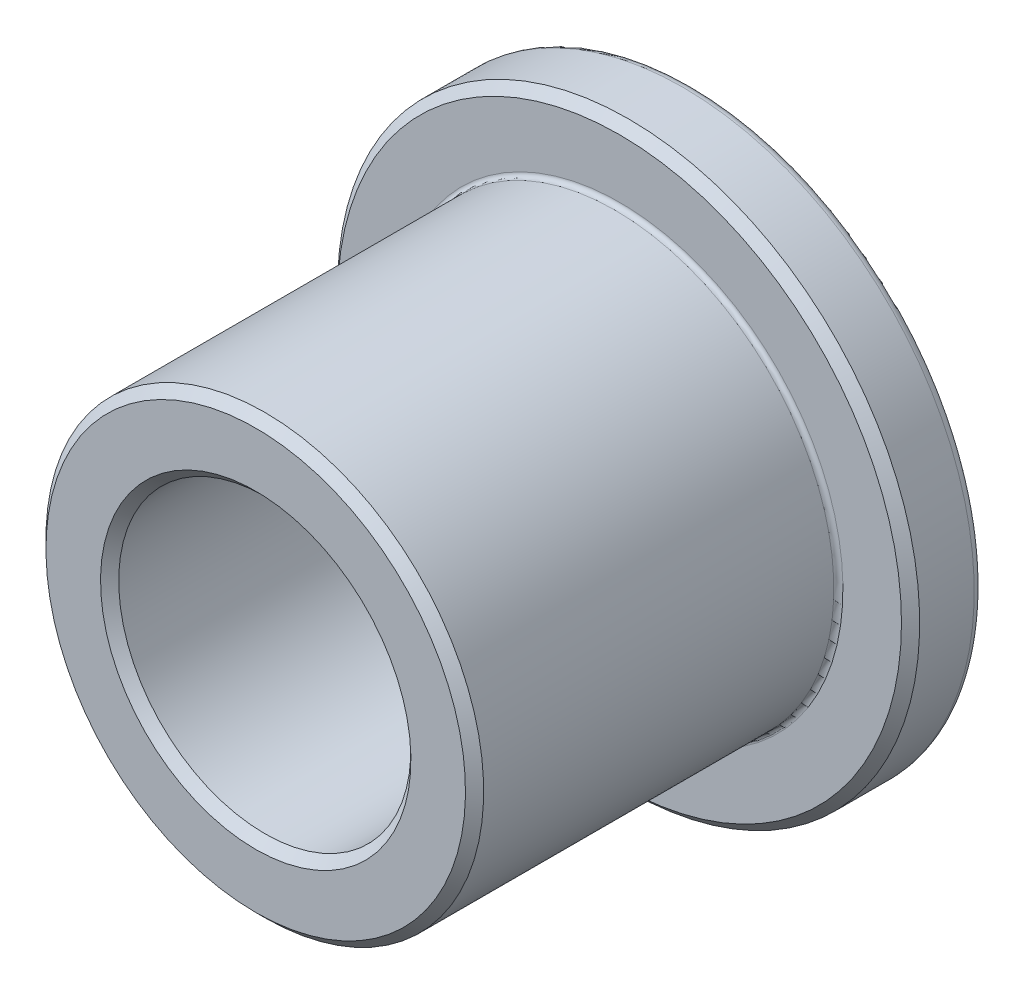
ISO-10303-21;
HEADER;
FILE_DESCRIPTION(('STEP AP214'),'2;1');
FILE_NAME('part.step','',(''),(''),'','','');
FILE_SCHEMA(('AUTOMOTIVE_DESIGN { 1 0 10303 214 1 1 1 1 }'));
ENDSEC;
DATA;
#1=APPLICATION_CONTEXT('core data for automotive mechanical design processes');
#2=APPLICATION_PROTOCOL_DEFINITION('international standard','automotive_design',2000,#1);
#3=PRODUCT_CONTEXT('',#1,'mechanical');
#4=PRODUCT('Part','Part','',(#3));
#5=PRODUCT_RELATED_PRODUCT_CATEGORY('part','',(#4));
#6=PRODUCT_DEFINITION_FORMATION('','',#4);
#7=PRODUCT_DEFINITION_CONTEXT('part definition',#1,'design');
#8=PRODUCT_DEFINITION('design','',#6,#7);
#9=PRODUCT_DEFINITION_SHAPE('','',#8);
#10=(LENGTH_UNIT() NAMED_UNIT(*) SI_UNIT(.MILLI.,.METRE.));
#11=(NAMED_UNIT(*) PLANE_ANGLE_UNIT() SI_UNIT($,.RADIAN.));
#12=(NAMED_UNIT(*) SI_UNIT($,.STERADIAN.) SOLID_ANGLE_UNIT());
#13=UNCERTAINTY_MEASURE_WITH_UNIT(LENGTH_MEASURE(1.E-05),#10,'distance_accuracy_value','');
#14=(GEOMETRIC_REPRESENTATION_CONTEXT(3) GLOBAL_UNCERTAINTY_ASSIGNED_CONTEXT((#13)) GLOBAL_UNIT_ASSIGNED_CONTEXT((#10,
#11,#12)) REPRESENTATION_CONTEXT('',''));
#15=CARTESIAN_POINT('',(0.,0.,0.));
#16=DIRECTION('',(0.,0.,1.));
#17=DIRECTION('',(1.,0.,0.));
#18=AXIS2_PLACEMENT_3D('',#15,#16,#17);
#19=CARTESIAN_POINT('',(0.,6.35,-4.7625));
#20=DIRECTION('',(0.,0.,-1.));
#21=DIRECTION('',(0.,1.,0.));
#22=AXIS2_PLACEMENT_3D('',#19,#20,#21);
#23=PLANE('',#22);
#24=CARTESIAN_POINT('',(0.,0.,-4.7625));
#25=DIRECTION('',(0.,0.,-1.));
#26=DIRECTION('',(0.,1.,0.));
#27=AXIS2_PLACEMENT_3D('',#24,#25,#26);
#28=CIRCLE('',#27,6.1515625);
#29=CARTESIAN_POINT('',(0.,6.1515625,-4.7625));
#30=VERTEX_POINT('',#29);
#31=EDGE_CURVE('E45',#30,#30,#28,.T.);
#32=ORIENTED_EDGE('',*,*,#31,.T.);
#33=EDGE_LOOP('',(#32));
#34=FACE_BOUND('',#33,.T.);
#35=CARTESIAN_POINT('',(0.,0.,-4.7625));
#36=DIRECTION('',(0.,0.,-1.));
#37=DIRECTION('',(0.,1.,0.));
#38=AXIS2_PLACEMENT_3D('',#35,#36,#37);
#39=CIRCLE('',#38,3.1877);
#40=CARTESIAN_POINT('',(0.,3.1877,-4.7625));
#41=VERTEX_POINT('',#40);
#42=EDGE_CURVE('E68',#41,#41,#39,.T.);
#43=ORIENTED_EDGE('',*,*,#42,.F.);
#44=EDGE_LOOP('',(#43));
#45=FACE_BOUND('',#44,.T.);
#46=ADVANCED_FACE('F30',(#34,#45),#23,.T.);
#47=CARTESIAN_POINT('',(0.,0.,-4.7625));
#48=DIRECTION('',(0.,0.,-1.));
#49=DIRECTION('',(0.,1.,0.));
#50=AXIS2_PLACEMENT_3D('',#47,#48,#49);
#51=CYLINDRICAL_SURFACE('',#50,6.35);
#52=CARTESIAN_POINT('',(0.,0.,-4.5640625));
#53=DIRECTION('',(0.,0.,-1.));
#54=DIRECTION('',(0.,1.,0.));
#55=AXIS2_PLACEMENT_3D('',#52,#53,#54);
#56=CIRCLE('',#55,6.35);
#57=CARTESIAN_POINT('',(0.,6.35,-4.5640625));
#58=VERTEX_POINT('',#57);
#59=EDGE_CURVE('E41',#58,#58,#56,.F.);
#60=ORIENTED_EDGE('',*,*,#59,.T.);
#61=EDGE_LOOP('',(#60));
#62=FACE_BOUND('',#61,.T.);
#63=CARTESIAN_POINT('',(0.,0.,-3.37343749999999));
#64=DIRECTION('',(0.,0.,1.));
#65=DIRECTION('',(0.,-1.,0.));
#66=AXIS2_PLACEMENT_3D('',#63,#64,#65);
#67=CIRCLE('',#66,6.35);
#68=CARTESIAN_POINT('',(0.,-6.35,-3.3734375));
#69=VERTEX_POINT('',#68);
#70=EDGE_CURVE('E65',#69,#69,#67,.F.);
#71=ORIENTED_EDGE('',*,*,#70,.T.);
#72=EDGE_LOOP('',(#71));
#73=FACE_BOUND('',#72,.T.);
#74=ADVANCED_FACE('F75',(#62,#73),#51,.T.);
#75=CARTESIAN_POINT('',(0.,6.35,-3.175));
#76=DIRECTION('',(0.,0.,1.));
#77=DIRECTION('',(0.,-1.,0.));
#78=AXIS2_PLACEMENT_3D('',#75,#76,#77);
#79=PLANE('',#78);
#80=CARTESIAN_POINT('',(0.,0.,-3.175));
#81=DIRECTION('',(0.,0.,1.));
#82=DIRECTION('',(0.,-1.,0.));
#83=AXIS2_PLACEMENT_3D('',#80,#81,#82);
#84=CIRCLE('',#83,4.87441875);
#85=CARTESIAN_POINT('',(0.,-4.87441875,-3.175));
#86=VERTEX_POINT('',#85);
#87=EDGE_CURVE('E37',#86,#86,#84,.F.);
#88=ORIENTED_EDGE('',*,*,#87,.T.);
#89=EDGE_LOOP('',(#88));
#90=FACE_BOUND('',#89,.T.);
#91=CARTESIAN_POINT('',(0.,0.,-3.175));
#92=DIRECTION('',(0.,0.,1.));
#93=DIRECTION('',(0.,-1.,0.));
#94=AXIS2_PLACEMENT_3D('',#91,#92,#93);
#95=CIRCLE('',#94,6.1515625);
#96=CARTESIAN_POINT('',(0.,-6.1515625,-3.175));
#97=VERTEX_POINT('',#96);
#98=EDGE_CURVE('E62',#97,#97,#95,.T.);
#99=ORIENTED_EDGE('',*,*,#98,.T.);
#100=EDGE_LOOP('',(#99));
#101=FACE_BOUND('',#100,.T.);
#102=ADVANCED_FACE('F81',(#90,#101),#79,.T.);
#103=CARTESIAN_POINT('',(0.,0.,-4.7625));
#104=DIRECTION('',(0.,0.,-1.));
#105=DIRECTION('',(0.,1.,0.));
#106=AXIS2_PLACEMENT_3D('',#103,#104,#105);
#107=CYLINDRICAL_SURFACE('',#106,4.7752);
#108=CARTESIAN_POINT('',(0.,0.,-3.07578125));
#109=DIRECTION('',(0.,0.,1.));
#110=DIRECTION('',(0.,-1.,0.));
#111=AXIS2_PLACEMENT_3D('',#108,#109,#110);
#112=CIRCLE('',#111,4.7752);
#113=CARTESIAN_POINT('',(0.,-4.7752,-3.07578125));
#114=VERTEX_POINT('',#113);
#115=EDGE_CURVE('E10',#114,#114,#112,.T.);
#116=ORIENTED_EDGE('',*,*,#115,.T.);
#117=EDGE_LOOP('',(#116));
#118=FACE_BOUND('',#117,.T.);
#119=CARTESIAN_POINT('',(0.,0.,4.5640625));
#120=DIRECTION('',(0.,0.,1.));
#121=DIRECTION('',(0.,-1.,0.));
#122=AXIS2_PLACEMENT_3D('',#119,#120,#121);
#123=CIRCLE('',#122,4.7752);
#124=CARTESIAN_POINT('',(0.,-4.7752,4.5640625));
#125=VERTEX_POINT('',#124);
#126=EDGE_CURVE('E59',#125,#125,#123,.F.);
#127=ORIENTED_EDGE('',*,*,#126,.T.);
#128=EDGE_LOOP('',(#127));
#129=FACE_BOUND('',#128,.T.);
#130=ADVANCED_FACE('F119',(#118,#129),#107,.T.);
#131=CARTESIAN_POINT('',(0.,4.7752,4.7625));
#132=DIRECTION('',(0.,0.,1.));
#133=DIRECTION('',(0.,-1.,0.));
#134=AXIS2_PLACEMENT_3D('',#131,#132,#133);
#135=PLANE('',#134);
#136=CARTESIAN_POINT('',(0.,0.,4.7625));
#137=DIRECTION('',(0.,0.,1.));
#138=DIRECTION('',(0.,-1.,0.));
#139=AXIS2_PLACEMENT_3D('',#136,#137,#138);
#140=CIRCLE('',#139,4.5767625);
#141=CARTESIAN_POINT('',(0.,-4.5767625,4.7625));
#142=VERTEX_POINT('',#141);
#143=EDGE_CURVE('E53',#142,#142,#140,.T.);
#144=ORIENTED_EDGE('',*,*,#143,.T.);
#145=EDGE_LOOP('',(#144));
#146=FACE_BOUND('',#145,.T.);
#147=CARTESIAN_POINT('',(0.,0.,4.7625));
#148=DIRECTION('',(0.,0.,1.));
#149=DIRECTION('',(0.,-1.,0.));
#150=AXIS2_PLACEMENT_3D('',#147,#148,#149);
#151=CIRCLE('',#150,3.3861375);
#152=CARTESIAN_POINT('',(0.,-3.3861375,4.7625));
#153=VERTEX_POINT('',#152);
#154=EDGE_CURVE('E56',#153,#153,#151,.F.);
#155=ORIENTED_EDGE('',*,*,#154,.T.);
#156=EDGE_LOOP('',(#155));
#157=FACE_BOUND('',#156,.T.);
#158=ADVANCED_FACE('F124',(#146,#157),#135,.T.);
#159=CARTESIAN_POINT('',(0.,0.,-4.7625));
#160=DIRECTION('',(0.,0.,-1.));
#161=DIRECTION('',(0.,1.,0.));
#162=AXIS2_PLACEMENT_3D('',#159,#160,#161);
#163=CYLINDRICAL_SURFACE('',#162,3.1877);
#164=CARTESIAN_POINT('',(0.,0.,4.5640625));
#165=DIRECTION('',(0.,0.,1.));
#166=DIRECTION('',(0.,-1.,0.));
#167=AXIS2_PLACEMENT_3D('',#164,#165,#166);
#168=CIRCLE('',#167,3.1877);
#169=CARTESIAN_POINT('',(0.,-3.1877,4.5640625));
#170=VERTEX_POINT('',#169);
#171=EDGE_CURVE('E50',#170,#170,#168,.T.);
#172=ORIENTED_EDGE('',*,*,#171,.T.);
#173=EDGE_LOOP('',(#172));
#174=FACE_BOUND('',#173,.T.);
#175=ORIENTED_EDGE('',*,*,#42,.T.);
#176=EDGE_LOOP('',(#175));
#177=FACE_BOUND('',#176,.T.);
#178=ADVANCED_FACE('F72',(#174,#177),#163,.F.);
#179=CARTESIAN_POINT('',(0.,0.,-3.37343749999999));
#180=DIRECTION('',(0.,0.,-1.));
#181=DIRECTION('',(0.,1.,0.));
#182=AXIS2_PLACEMENT_3D('',#179,#180,#181);
#183=CONICAL_SURFACE('',#182,6.35,0.78539816339745);
#184=ORIENTED_EDGE('',*,*,#98,.F.);
#185=EDGE_LOOP('',(#184));
#186=FACE_BOUND('',#185,.T.);
#187=ORIENTED_EDGE('',*,*,#70,.F.);
#188=EDGE_LOOP('',(#187));
#189=FACE_BOUND('',#188,.T.);
#190=ADVANCED_FACE('F86',(#186,#189),#183,.T.);
#191=CARTESIAN_POINT('',(0.,0.,4.5640625));
#192=DIRECTION('',(0.,0.,-1.));
#193=DIRECTION('',(0.,1.,0.));
#194=AXIS2_PLACEMENT_3D('',#191,#192,#193);
#195=CONICAL_SURFACE('',#194,4.7752,0.785398163397448);
#196=ORIENTED_EDGE('',*,*,#143,.F.);
#197=EDGE_LOOP('',(#196));
#198=FACE_BOUND('',#197,.T.);
#199=ORIENTED_EDGE('',*,*,#126,.F.);
#200=EDGE_LOOP('',(#199));
#201=FACE_BOUND('',#200,.T.);
#202=ADVANCED_FACE('F89',(#198,#201),#195,.T.);
#203=CARTESIAN_POINT('',(0.,0.,4.7625));
#204=DIRECTION('',(0.,0.,1.));
#205=DIRECTION('',(0.,-1.,0.));
#206=AXIS2_PLACEMENT_3D('',#203,#204,#205);
#207=CONICAL_SURFACE('',#206,3.3861375,0.785398163397443);
#208=ORIENTED_EDGE('',*,*,#171,.F.);
#209=EDGE_LOOP('',(#208));
#210=FACE_BOUND('',#209,.T.);
#211=ORIENTED_EDGE('',*,*,#154,.F.);
#212=EDGE_LOOP('',(#211));
#213=FACE_BOUND('',#212,.T.);
#214=ADVANCED_FACE('F93',(#210,#213),#207,.F.);
#215=CARTESIAN_POINT('',(0.,0.,-4.5640625));
#216=DIRECTION('',(0.,0.,-1.));
#217=DIRECTION('',(0.,1.,0.));
#218=AXIS2_PLACEMENT_3D('',#215,#216,#217);
#219=TOROIDAL_SURFACE('',#218,6.1515625,0.1984375);
#220=ORIENTED_EDGE('',*,*,#59,.F.);
#221=EDGE_LOOP('',(#220));
#222=FACE_BOUND('',#221,.T.);
#223=ORIENTED_EDGE('',*,*,#31,.F.);
#224=EDGE_LOOP('',(#223));
#225=FACE_BOUND('',#224,.T.);
#226=ADVANCED_FACE('F96',(#222,#225),#219,.T.);
#227=CARTESIAN_POINT('',(0.,0.,-3.07578125));
#228=DIRECTION('',(0.,0.,1.));
#229=DIRECTION('',(0.,-1.,0.));
#230=AXIS2_PLACEMENT_3D('',#227,#228,#229);
#231=TOROIDAL_SURFACE('',#230,4.87441875,0.09921875);
#232=ORIENTED_EDGE('',*,*,#115,.F.);
#233=EDGE_LOOP('',(#232));
#234=FACE_BOUND('',#233,.T.);
#235=ORIENTED_EDGE('',*,*,#87,.F.);
#236=EDGE_LOOP('',(#235));
#237=FACE_BOUND('',#236,.T.);
#238=ADVANCED_FACE('F32',(#234,#237),#231,.F.);
#239=CLOSED_SHELL('',(#46,#74,#102,#130,#158,#178,#190,#202,#214,#226,#238));
#240=MANIFOLD_SOLID_BREP('B2',#239);
#241=ADVANCED_BREP_SHAPE_REPRESENTATION('',(#18,#240),#14);
#242=SHAPE_DEFINITION_REPRESENTATION(#9,#241);
ENDSEC;
END-ISO-10303-21;
